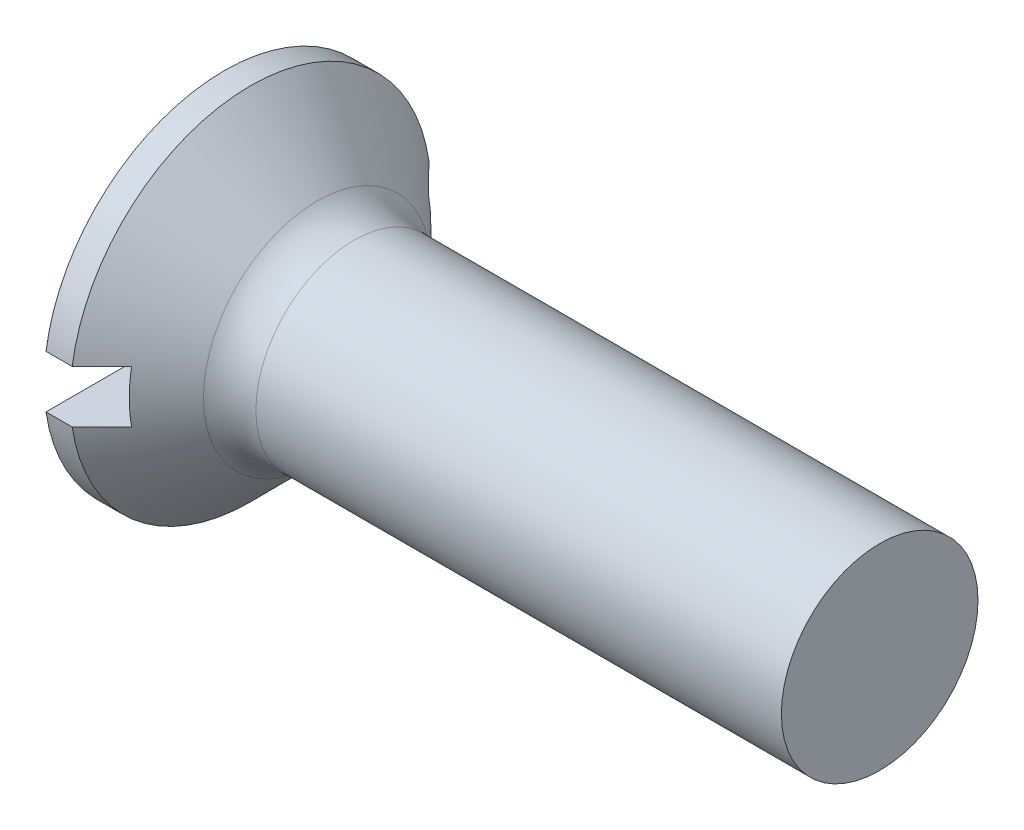
ISO-10303-21;
HEADER;
FILE_DESCRIPTION(('STEP AP214'),'2;1');
FILE_NAME('part.step','',(''),(''),'','','');
FILE_SCHEMA(('AUTOMOTIVE_DESIGN { 1 0 10303 214 1 1 1 1 }'));
ENDSEC;
DATA;
#1=APPLICATION_CONTEXT('core data for automotive mechanical design processes');
#2=APPLICATION_PROTOCOL_DEFINITION('international standard','automotive_design',2000,#1);
#3=PRODUCT_CONTEXT('',#1,'mechanical');
#4=PRODUCT('Part','Part','',(#3));
#5=PRODUCT_RELATED_PRODUCT_CATEGORY('part','',(#4));
#6=PRODUCT_DEFINITION_FORMATION('','',#4);
#7=PRODUCT_DEFINITION_CONTEXT('part definition',#1,'design');
#8=PRODUCT_DEFINITION('design','',#6,#7);
#9=PRODUCT_DEFINITION_SHAPE('','',#8);
#10=(LENGTH_UNIT() NAMED_UNIT(*) SI_UNIT(.MILLI.,.METRE.));
#11=(NAMED_UNIT(*) PLANE_ANGLE_UNIT() SI_UNIT($,.RADIAN.));
#12=(NAMED_UNIT(*) SI_UNIT($,.STERADIAN.) SOLID_ANGLE_UNIT());
#13=UNCERTAINTY_MEASURE_WITH_UNIT(LENGTH_MEASURE(1.E-05),#10,'distance_accuracy_value','');
#14=(GEOMETRIC_REPRESENTATION_CONTEXT(3) GLOBAL_UNCERTAINTY_ASSIGNED_CONTEXT((#13)) GLOBAL_UNIT_ASSIGNED_CONTEXT((#10,
#11,#12)) REPRESENTATION_CONTEXT('',''));
#15=CARTESIAN_POINT('',(0.,0.,0.));
#16=DIRECTION('',(0.,0.,1.));
#17=DIRECTION('',(1.,0.,0.));
#18=AXIS2_PLACEMENT_3D('',#15,#16,#17);
#19=CARTESIAN_POINT('',(-6.34999999999999,0.,0.));
#20=DIRECTION('',(-1.,0.,0.));
#21=DIRECTION('',(0.,0.,1.));
#22=AXIS2_PLACEMENT_3D('',#19,#20,#21);
#23=CYLINDRICAL_SURFACE('',#22,2.75);
#24=DIRECTION('',(-1.,0.,0.));
#25=VECTOR('',#24,1.);
#26=CARTESIAN_POINT('',(-6.34999999999999,0.4,-2.72075357208256));
#27=LINE('',#26,#25);
#28=CARTESIAN_POINT('',(0.,0.4,-2.72075357208256));
#29=VERTEX_POINT('',#28);
#30=CARTESIAN_POINT('',(0.400000000000005,0.4,-2.72075357208256));
#31=VERTEX_POINT('',#30);
#32=EDGE_CURVE('E55',#29,#31,#27,.F.);
#33=ORIENTED_EDGE('',*,*,#32,.F.);
#34=CARTESIAN_POINT('',(0.,0.,0.));
#35=DIRECTION('',(-1.,0.,0.));
#36=DIRECTION('',(0.,0.,1.));
#37=AXIS2_PLACEMENT_3D('',#34,#35,#36);
#38=CIRCLE('',#37,2.75);
#39=CARTESIAN_POINT('',(0.,0.4,2.72075357208256));
#40=VERTEX_POINT('',#39);
#41=EDGE_CURVE('E103',#40,#29,#38,.T.);
#42=ORIENTED_EDGE('',*,*,#41,.F.);
#43=DIRECTION('',(-1.,0.,0.));
#44=VECTOR('',#43,1.);
#45=CARTESIAN_POINT('',(-6.34999999999999,0.4,2.72075357208256));
#46=LINE('',#45,#44);
#47=CARTESIAN_POINT('',(0.400000000000005,0.4,2.72075357208256));
#48=VERTEX_POINT('',#47);
#49=EDGE_CURVE('E160',#48,#40,#46,.T.);
#50=ORIENTED_EDGE('',*,*,#49,.F.);
#51=CARTESIAN_POINT('',(0.400000000000005,0.,0.));
#52=DIRECTION('',(-1.,0.,0.));
#53=DIRECTION('',(0.,0.,1.));
#54=AXIS2_PLACEMENT_3D('',#51,#52,#53);
#55=CIRCLE('',#54,2.75);
#56=EDGE_CURVE('E112',#48,#31,#55,.T.);
#57=ORIENTED_EDGE('',*,*,#56,.T.);
#58=EDGE_LOOP('',(#33,#42,#50,#57));
#59=FACE_BOUND('',#58,.T.);
#60=ADVANCED_FACE('F32',(#59),#23,.T.);
#61=CARTESIAN_POINT('',(0.,0.,0.));
#62=DIRECTION('',(-1.,0.,0.));
#63=DIRECTION('',(0.,0.,1.));
#64=AXIS2_PLACEMENT_3D('',#61,#62,#63);
#65=PLANE('',#64);
#66=DIRECTION('',(0.,0.,-1.));
#67=VECTOR('',#66,1.);
#68=CARTESIAN_POINT('',(0.,0.4,0.));
#69=LINE('',#68,#67);
#70=EDGE_CURVE('E90',#40,#29,#69,.T.);
#71=ORIENTED_EDGE('',*,*,#70,.F.);
#72=ORIENTED_EDGE('',*,*,#41,.T.);
#73=EDGE_LOOP('',(#71,#72));
#74=FACE_BOUND('',#73,.T.);
#75=ADVANCED_FACE('F166',(#74),#65,.T.);
#76=CARTESIAN_POINT('',(10.,1.5,0.));
#77=DIRECTION('',(1.,0.,0.));
#78=DIRECTION('',(0.,0.,-1.));
#79=AXIS2_PLACEMENT_3D('',#76,#77,#78);
#80=PLANE('',#79);
#81=CARTESIAN_POINT('',(10.,0.,0.));
#82=DIRECTION('',(-1.,0.,0.));
#83=DIRECTION('',(0.,0.,1.));
#84=AXIS2_PLACEMENT_3D('',#81,#82,#83);
#85=CIRCLE('',#84,1.5);
#86=CARTESIAN_POINT('',(10.,0.,1.5));
#87=VERTEX_POINT('',#86);
#88=EDGE_CURVE('E113',#87,#87,#85,.T.);
#89=ORIENTED_EDGE('',*,*,#88,.F.);
#90=EDGE_LOOP('',(#89));
#91=FACE_BOUND('',#90,.T.);
#92=ADVANCED_FACE('F168',(#91),#80,.T.);
#93=CARTESIAN_POINT('',(-6.34999999999999,0.,0.));
#94=DIRECTION('',(-1.,0.,0.));
#95=DIRECTION('',(0.,0.,1.));
#96=AXIS2_PLACEMENT_3D('',#93,#94,#95);
#97=CYLINDRICAL_SURFACE('',#96,1.5);
#98=CARTESIAN_POINT('',(1.98137084989848,0.,0.));
#99=DIRECTION('',(-1.,0.,0.));
#100=DIRECTION('',(0.,0.,1.));
#101=AXIS2_PLACEMENT_3D('',#98,#99,#100);
#102=CIRCLE('',#101,1.5);
#103=CARTESIAN_POINT('',(1.98137084989848,0.,1.5));
#104=VERTEX_POINT('',#103);
#105=EDGE_CURVE('E91',#104,#104,#102,.F.);
#106=ORIENTED_EDGE('',*,*,#105,.T.);
#107=EDGE_LOOP('',(#106));
#108=FACE_BOUND('',#107,.T.);
#109=ORIENTED_EDGE('',*,*,#88,.T.);
#110=EDGE_LOOP('',(#109));
#111=FACE_BOUND('',#110,.T.);
#112=ADVANCED_FACE('F173',(#108,#111),#97,.T.);
#113=CARTESIAN_POINT('',(0.400000000000005,0.,0.));
#114=DIRECTION('',(-1.,0.,0.));
#115=DIRECTION('',(0.,0.,1.));
#116=AXIS2_PLACEMENT_3D('',#113,#114,#115);
#117=CONICAL_SURFACE('',#116,2.75,0.78539816339745);
#118=CARTESIAN_POINT('',(-2.91122703099808,0.399999999999999,-6.04801398157296));
#119=CARTESIAN_POINT('',(-2.70333669995712,0.399999999999999,-5.83966573752139));
#120=CARTESIAN_POINT('',(-2.49546630031166,0.399999999999999,-5.63129758737052));
#121=CARTESIAN_POINT('',(-2.07978706521848,0.399999999999999,-5.2144912620075));
#122=CARTESIAN_POINT('',(-1.87197823113852,0.399999999999999,-5.00605308543134));
#123=CARTESIAN_POINT('',(-1.45635477241037,0.399999999999999,-4.58898711382912));
#124=CARTESIAN_POINT('',(-1.2485401909839,0.399999999999999,-4.38035927572767));
#125=CARTESIAN_POINT('',(-0.833054486611349,0.399999999999999,-3.96296915720086));
#126=CARTESIAN_POINT('',(-0.625383360847279,0.399999999999999,-3.75420687958157));
#127=CARTESIAN_POINT('',(-0.208177797150706,0.399999999999999,-3.33435396336398));
#128=CARTESIAN_POINT('',(0.00135434759481753,0.4,-3.12326104596609));
#129=CARTESIAN_POINT('',(0.420030451513073,0.4,-2.70066518043499));
#130=CARTESIAN_POINT('',(0.629174386878202,0.4,-2.48916220868138));
#131=CARTESIAN_POINT('',(0.942224156138593,0.4,-2.1713129981671));
#132=CARTESIAN_POINT('',(1.04644766129475,0.4,-2.06527989301767));
#133=CARTESIAN_POINT('',(1.25455725538018,0.4,-1.85287805131423));
#134=CARTESIAN_POINT('',(1.35844333617521,0.4,-1.7465093067891));
#135=CARTESIAN_POINT('',(1.56564763937195,0.4,-1.53324094855307));
#136=CARTESIAN_POINT('',(1.66896592306241,0.4,-1.42634139460757));
#137=CARTESIAN_POINT('',(1.82313895681254,0.4,-1.26522565766366));
#138=CARTESIAN_POINT('',(1.87439491657569,0.4,-1.21139372905201));
#139=CARTESIAN_POINT('',(1.9765104755376,0.4,-1.10335558747567));
#140=CARTESIAN_POINT('',(2.02737008031461,0.4,-1.04914937979886));
#141=CARTESIAN_POINT('',(2.10536761914265,0.4,-0.965078768929768));
#142=CARTESIAN_POINT('',(2.13272119248435,0.4,-0.935414601324456));
#143=CARTESIAN_POINT('',(2.18719151166742,0.4,-0.875868286782248));
#144=CARTESIAN_POINT('',(2.21430825226833,0.4,-0.845986135048678));
#145=CARTESIAN_POINT('',(2.26822565449431,0.4,-0.785940027475329));
#146=CARTESIAN_POINT('',(2.29502633530682,0.4,-0.755776088943663));
#147=CARTESIAN_POINT('',(2.34818681038839,0.4,-0.695065970456104));
#148=CARTESIAN_POINT('',(2.37454662451584,0.4,-0.664519807826037));
#149=CARTESIAN_POINT('',(2.43976155242959,0.4,-0.587422608894616));
#150=CARTESIAN_POINT('',(2.4782379170761,0.4,-0.540543920717876));
#151=CARTESIAN_POINT('',(2.53401321051795,0.4,-0.468681597610833));
#152=CARTESIAN_POINT('',(2.55228877360357,0.4,-0.444459986191995));
#153=CARTESIAN_POINT('',(2.5878711479654,0.4,-0.39531915610884));
#154=CARTESIAN_POINT('',(2.60517823468484,0.4,-0.370400138848683));
#155=CARTESIAN_POINT('',(2.64157672655789,0.4,-0.314684261327312));
#156=CARTESIAN_POINT('',(2.66036306205222,0.4,-0.28368484243835));
#157=CARTESIAN_POINT('',(2.69440764635418,0.4,-0.219761693796643));
#158=CARTESIAN_POINT('',(2.70967206186428,0.4,-0.186841455937733));
#159=CARTESIAN_POINT('',(2.73016014153724,0.4,-0.129375221596078));
#160=CARTESIAN_POINT('',(2.73703138273339,0.4,-0.105439966049049));
#161=CARTESIAN_POINT('',(2.74668434716516,0.4,-0.0567945818244743));
#162=CARTESIAN_POINT('',(2.74948035548682,0.4,-0.0320874714607019));
#163=CARTESIAN_POINT('',(2.75038742305556,0.4,0.0175418217821301));
#164=CARTESIAN_POINT('',(2.74847509810649,0.4,0.0424644630823507));
#165=CARTESIAN_POINT('',(2.7403655224137,0.4,0.0916234589116821));
#166=CARTESIAN_POINT('',(2.73415677384007,0.4,0.115857789823385));
#167=CARTESIAN_POINT('',(2.71827371927204,0.4,0.164097461973524));
#168=CARTESIAN_POINT('',(2.70848082711735,0.4,0.188061916430982));
#169=CARTESIAN_POINT('',(2.68657810309996,0.4,0.234925488056131));
#170=CARTESIAN_POINT('',(2.67446406551726,0.4,0.257822576152259));
#171=CARTESIAN_POINT('',(2.64859519565537,0.4,0.302903050832693));
#172=CARTESIAN_POINT('',(2.63482775852877,0.4,0.325079071971884));
#173=CARTESIAN_POINT('',(2.60624001527761,0.4,0.368705812927868));
#174=CARTESIAN_POINT('',(2.59142061970022,0.4,0.390157136844758));
#175=CARTESIAN_POINT('',(2.54324495089253,0.4,0.457380684412003));
#176=CARTESIAN_POINT('',(2.5085311578627,0.4,0.502172551984684));
#177=CARTESIAN_POINT('',(2.4373574689067,0.4,0.590355519981424));
#178=CARTESIAN_POINT('',(2.40089644203552,0.4,0.633745681848963));
#179=CARTESIAN_POINT('',(2.32688330317303,0.4,0.719722652435567));
#180=CARTESIAN_POINT('',(2.28932931399318,0.4,0.762307843089061));
#181=CARTESIAN_POINT('',(2.21358878416378,0.4,0.846885546517387));
#182=CARTESIAN_POINT('',(2.17540243181154,0.4,0.888878229061745));
#183=CARTESIAN_POINT('',(2.06044068334854,0.4,1.01402227230979));
#184=CARTESIAN_POINT('',(1.98303698108055,0.4,1.09659540299884));
#185=CARTESIAN_POINT('',(1.82747335677727,0.4,1.26085212091516));
#186=CARTESIAN_POINT('',(1.74931433456999,0.4,1.34253656700302));
#187=CARTESIAN_POINT('',(1.59286602877705,0.4,1.50504082503211));
#188=CARTESIAN_POINT('',(1.51457909296922,0.4,1.58586289734369));
#189=CARTESIAN_POINT('',(1.35769196697884,0.4,1.74720261153539));
#190=CARTESIAN_POINT('',(1.27909177531288,0.4,1.82772025197037));
#191=CARTESIAN_POINT('',(1.04297819662847,0.4,2.06897290850551));
#192=CARTESIAN_POINT('',(0.885154889242076,0.4,2.22940447684664));
#193=CARTESIAN_POINT('',(0.569022750342737,0.4,2.54992542692343));
#194=CARTESIAN_POINT('',(0.410713737476895,0.4,2.71001462943086));
#195=CARTESIAN_POINT('',(0.093846751706257,0.4,3.02994348223417));
#196=CARTESIAN_POINT('',(-0.0647112188507847,0.4,3.18978313485537));
#197=CARTESIAN_POINT('',(-0.540591127347246,0.4,3.66904928426922));
#198=CARTESIAN_POINT('',(-0.858143098403681,0.400000000000001,3.98824727310349));
#199=CARTESIAN_POINT('',(-1.49349686932324,0.400000000000001,4.62632608508985));
#200=CARTESIAN_POINT('',(-1.81129863870678,0.400000000000001,4.94520693861199));
#201=CARTESIAN_POINT('',(-2.25950055023475,0.400000000000001,5.39470040618395));
#202=CARTESIAN_POINT('',(-2.38983276816512,0.400000000000001,5.5253807505132));
#203=CARTESIAN_POINT('',(-2.65051602794782,0.400000000000001,5.78671502436768));
#204=CARTESIAN_POINT('',(-2.78086706913672,0.400000000000001,5.91736895455466));
#205=CARTESIAN_POINT('',(-2.91122703099808,0.400000000000001,6.04801398157296));
#206=B_SPLINE_CURVE_WITH_KNOTS('',3,(#118,#119,#120,#121,#122,#123,#124,#125,#126,#127,#128,
#129,#130,#131,#132,#133,#134,#135,#136,#137,#138,#139,#140,#141,#142,#143,#144,#145,#146,#147,
#148,#149,#150,#151,#152,#153,#154,#155,#156,#157,#158,#159,#160,#161,#162,#163,#164,#165,#166,
#167,#168,#169,#170,#171,#172,#173,#174,#175,#176,#177,#178,#179,#180,#181,#182,#183,#184,#185,
#186,#187,#188,#189,#190,#191,#192,#193,#194,#195,#196,#197,#198,#199,#200,#201,#202,#203,#204,
#205),.UNSPECIFIED.,.F.,.F.,(4,2,2,2,2,2,2,2,2,2,2,2,2,2,2,2,2,2,2,2,2,2,2,2,2,2,2,2,2,2,2,2,2,
2,2,2,2,2,2,2,2,2,2,4),(0.,0.882975910860478,1.76597015363403,2.64937958225391,3.53277113384024,
4.42505762724969,5.31739714423807,5.76343472500757,6.20948297970986,6.65548210253547,
6.87847301535126,7.10146078413753,7.22251193727136,7.34356576218222,7.46461219989591,
7.58565317043343,7.7675312303056,7.85854400270903,7.94953075732351,8.05816632031485,
8.16661019949531,8.24105170239749,8.31523162951187,8.38978071779309,8.46453008531399,
8.54201686233401,8.61964538973785,8.69790858090398,8.77610483669631,8.94600506687254,
9.11601679556836,9.28634010861835,9.45661358569747,9.79613758747497,10.1352975424543,
10.4728599134667,10.8104238848897,11.4855651220709,12.1610000728679,12.8364286918874,
14.1871833908349,15.5377930820782,16.0914848296691,16.6451603543132),.UNSPECIFIED.);
#207=CARTESIAN_POINT('',(0.85,0.4,-2.26495033058123));
#208=VERTEX_POINT('',#207);
#209=EDGE_CURVE('E104',#31,#208,#206,.T.);
#210=ORIENTED_EDGE('',*,*,#209,.F.);
#211=ORIENTED_EDGE('',*,*,#56,.F.);
#212=CARTESIAN_POINT('',(0.85,0.4,2.26495033058123));
#213=VERTEX_POINT('',#212);
#214=EDGE_CURVE('E108',#213,#48,#206,.T.);
#215=ORIENTED_EDGE('',*,*,#214,.F.);
#216=CARTESIAN_POINT('',(0.85,0.,0.));
#217=DIRECTION('',(-1.,0.,0.));
#218=DIRECTION('',(0.,0.,1.));
#219=AXIS2_PLACEMENT_3D('',#216,#217,#218);
#220=CIRCLE('',#219,2.3);
#221=CARTESIAN_POINT('',(0.85,-0.400000000000001,2.26495033058123));
#222=VERTEX_POINT('',#221);
#223=EDGE_CURVE('E36',#213,#222,#220,.F.);
#224=ORIENTED_EDGE('',*,*,#223,.T.);
#225=CARTESIAN_POINT('',(-2.91122703099808,-0.400000000000001,6.04801398157296));
#226=CARTESIAN_POINT('',(-2.70333669995712,-0.400000000000001,5.83966573752139));
#227=CARTESIAN_POINT('',(-2.49546630031166,-0.400000000000001,5.63129758737052));
#228=CARTESIAN_POINT('',(-2.07978706521847,-0.400000000000001,5.2144912620075));
#229=CARTESIAN_POINT('',(-1.87197823113852,-0.400000000000001,5.00605308543134));
#230=CARTESIAN_POINT('',(-1.45635477241037,-0.400000000000001,4.58898711382912));
#231=CARTESIAN_POINT('',(-1.2485401909839,-0.400000000000001,4.38035927572767));
#232=CARTESIAN_POINT('',(-0.833054486611349,-0.400000000000001,3.96296915720086));
#233=CARTESIAN_POINT('',(-0.625383360847279,-0.400000000000001,3.75420687958157));
#234=CARTESIAN_POINT('',(-0.208177797150705,-0.400000000000001,3.33435396336398));
#235=CARTESIAN_POINT('',(0.00135434759481899,-0.400000000000001,3.12326104596609));
#236=CARTESIAN_POINT('',(0.420030451513074,-0.400000000000001,2.70066518043499));
#237=CARTESIAN_POINT('',(0.629174386878203,-0.400000000000001,2.48916220868137));
#238=CARTESIAN_POINT('',(0.942224156138594,-0.400000000000001,2.1713129981671));
#239=CARTESIAN_POINT('',(1.04644766129475,-0.400000000000001,2.06527989301766));
#240=CARTESIAN_POINT('',(1.25455725538018,-0.400000000000001,1.85287805131423));
#241=CARTESIAN_POINT('',(1.35844333617521,-0.400000000000001,1.7465093067891));
#242=CARTESIAN_POINT('',(1.56564763937195,-0.400000000000001,1.53324094855307));
#243=CARTESIAN_POINT('',(1.66896592306241,-0.400000000000001,1.42634139460756));
#244=CARTESIAN_POINT('',(1.82313895681255,-0.400000000000001,1.26522565766366));
#245=CARTESIAN_POINT('',(1.87439491657569,-0.400000000000001,1.211393729052));
#246=CARTESIAN_POINT('',(1.97651047553761,-0.400000000000001,1.10335558747567));
#247=CARTESIAN_POINT('',(2.02737008031461,-0.400000000000001,1.04914937979886));
#248=CARTESIAN_POINT('',(2.10536761914265,-0.400000000000001,0.965078768929766));
#249=CARTESIAN_POINT('',(2.13272119248435,-0.400000000000001,0.935414601324454));
#250=CARTESIAN_POINT('',(2.18719151166742,-0.400000000000001,0.875868286782245));
#251=CARTESIAN_POINT('',(2.21430825226833,-0.400000000000001,0.845986135048675));
#252=CARTESIAN_POINT('',(2.26822565449431,-0.400000000000001,0.785940027475326));
#253=CARTESIAN_POINT('',(2.29502633530682,-0.400000000000001,0.755776088943661));
#254=CARTESIAN_POINT('',(2.3481868103884,-0.400000000000001,0.695065970456102));
#255=CARTESIAN_POINT('',(2.37454662451584,-0.400000000000001,0.664519807826035));
#256=CARTESIAN_POINT('',(2.43976155242959,-0.400000000000001,0.587422608894614));
#257=CARTESIAN_POINT('',(2.4782379170761,-0.400000000000001,0.540543920717874));
#258=CARTESIAN_POINT('',(2.53401321051796,-0.400000000000001,0.468681597610831));
#259=CARTESIAN_POINT('',(2.55228877360357,-0.400000000000001,0.444459986191993));
#260=CARTESIAN_POINT('',(2.5878711479654,-0.400000000000001,0.395319156108837));
#261=CARTESIAN_POINT('',(2.60517823468485,-0.400000000000001,0.37040013884868));
#262=CARTESIAN_POINT('',(2.64157672655789,-0.400000000000001,0.314684261327309));
#263=CARTESIAN_POINT('',(2.66036306205222,-0.400000000000001,0.283684842438347));
#264=CARTESIAN_POINT('',(2.69440764635418,-0.400000000000001,0.219761693796641));
#265=CARTESIAN_POINT('',(2.70967206186428,-0.400000000000001,0.186841455937732));
#266=CARTESIAN_POINT('',(2.73016014153724,-0.400000000000001,0.129375221596077));
#267=CARTESIAN_POINT('',(2.73703138273339,-0.400000000000001,0.105439966049048));
#268=CARTESIAN_POINT('',(2.74668434716516,-0.400000000000001,0.056794581824473));
#269=CARTESIAN_POINT('',(2.74948035548682,-0.400000000000001,0.0320874714607006));
#270=CARTESIAN_POINT('',(2.75038742305555,-0.400000000000001,-0.0175418217821318));
#271=CARTESIAN_POINT('',(2.74847509810649,-0.400000000000001,-0.0424644630823528));
#272=CARTESIAN_POINT('',(2.7403655224137,-0.400000000000001,-0.0916234589116841));
#273=CARTESIAN_POINT('',(2.73415677384007,-0.400000000000001,-0.115857789823386));
#274=CARTESIAN_POINT('',(2.71827371927204,-0.400000000000001,-0.164097461973525));
#275=CARTESIAN_POINT('',(2.70848082711735,-0.400000000000001,-0.188061916430984));
#276=CARTESIAN_POINT('',(2.68657810309996,-0.400000000000001,-0.234925488056133));
#277=CARTESIAN_POINT('',(2.67446406551725,-0.400000000000001,-0.257822576152262));
#278=CARTESIAN_POINT('',(2.64859519565537,-0.400000000000001,-0.302903050832697));
#279=CARTESIAN_POINT('',(2.63482775852876,-0.400000000000001,-0.325079071971888));
#280=CARTESIAN_POINT('',(2.60624001527761,-0.400000000000001,-0.368705812927873));
#281=CARTESIAN_POINT('',(2.59142061970022,-0.400000000000001,-0.390157136844761));
#282=CARTESIAN_POINT('',(2.54324495089253,-0.400000000000001,-0.457380684412007));
#283=CARTESIAN_POINT('',(2.5085311578627,-0.400000000000001,-0.502172551984688));
#284=CARTESIAN_POINT('',(2.43735746890669,-0.400000000000001,-0.590355519981429));
#285=CARTESIAN_POINT('',(2.40089644203552,-0.400000000000001,-0.633745681848969));
#286=CARTESIAN_POINT('',(2.32688330317302,-0.400000000000001,-0.719722652435574));
#287=CARTESIAN_POINT('',(2.28932931399317,-0.400000000000001,-0.762307843089068));
#288=CARTESIAN_POINT('',(2.21358878416377,-0.400000000000001,-0.846885546517395));
#289=CARTESIAN_POINT('',(2.17540243181154,-0.400000000000001,-0.888878229061753));
#290=CARTESIAN_POINT('',(2.06044068334853,-0.400000000000001,-1.01402227230979));
#291=CARTESIAN_POINT('',(1.98303698108054,-0.400000000000001,-1.09659540299885));
#292=CARTESIAN_POINT('',(1.82747335677725,-0.400000000000001,-1.26085212091518));
#293=CARTESIAN_POINT('',(1.74931433456998,-0.400000000000001,-1.34253656700303));
#294=CARTESIAN_POINT('',(1.59286602877704,-0.400000000000001,-1.50504082503213));
#295=CARTESIAN_POINT('',(1.51457909296921,-0.400000000000001,-1.5858628973437));
#296=CARTESIAN_POINT('',(1.35769196697882,-0.400000000000001,-1.74720261153541));
#297=CARTESIAN_POINT('',(1.27909177531287,-0.400000000000001,-1.82772025197039));
#298=CARTESIAN_POINT('',(1.04297819662845,-0.400000000000001,-2.06897290850553));
#299=CARTESIAN_POINT('',(0.885154889242053,-0.400000000000001,-2.22940447684666));
#300=CARTESIAN_POINT('',(0.56902275034271,-0.400000000000001,-2.54992542692346));
#301=CARTESIAN_POINT('',(0.410713737476867,-0.400000000000001,-2.71001462943089));
#302=CARTESIAN_POINT('',(0.0938467517062253,-0.400000000000001,-3.0299434822342));
#303=CARTESIAN_POINT('',(-0.0647112188508182,-0.400000000000001,-3.1897831348554));
#304=CARTESIAN_POINT('',(-0.540591127347285,-0.400000000000001,-3.66904928426926));
#305=CARTESIAN_POINT('',(-0.858143098403724,-0.400000000000001,-3.98824727310353));
#306=CARTESIAN_POINT('',(-1.49349686932329,-0.400000000000001,-4.62632608508989));
#307=CARTESIAN_POINT('',(-1.81129863870683,-0.400000000000001,-4.94520693861204));
#308=CARTESIAN_POINT('',(-2.25950055023479,-0.400000000000001,-5.394700406184));
#309=CARTESIAN_POINT('',(-2.38983276816516,-0.400000000000001,-5.52538075051324));
#310=CARTESIAN_POINT('',(-2.65051602794784,-0.400000000000001,-5.7867150243677));
#311=CARTESIAN_POINT('',(-2.78086706913673,-0.400000000000001,-5.91736895455467));
#312=CARTESIAN_POINT('',(-2.91122703099808,-0.400000000000001,-6.04801398157296));
#313=B_SPLINE_CURVE_WITH_KNOTS('',3,(#225,#226,#227,#228,#229,#230,#231,#232,#233,#234,#235,
#236,#237,#238,#239,#240,#241,#242,#243,#244,#245,#246,#247,#248,#249,#250,#251,#252,#253,#254,
#255,#256,#257,#258,#259,#260,#261,#262,#263,#264,#265,#266,#267,#268,#269,#270,#271,#272,#273,
#274,#275,#276,#277,#278,#279,#280,#281,#282,#283,#284,#285,#286,#287,#288,#289,#290,#291,#292,
#293,#294,#295,#296,#297,#298,#299,#300,#301,#302,#303,#304,#305,#306,#307,#308,#309,#310,#311,
#312),.UNSPECIFIED.,.F.,.F.,(4,2,2,2,2,2,2,2,2,2,2,2,2,2,2,2,2,2,2,2,2,2,2,2,2,2,2,2,2,2,2,2,2,
2,2,2,2,2,2,2,2,2,2,4),(0.,0.882975910860477,1.76597015363403,2.6493795822539,3.53277113384024,
4.42505762724969,5.31739714423807,5.76343472500757,6.20948297970986,6.65548210253547,
6.87847301535126,7.10146078413754,7.22251193727136,7.34356576218222,7.46461219989591,
7.58565317043343,7.7675312303056,7.85854400270903,7.94953075732351,8.05816632031486,
8.16661019949531,8.24105170239749,8.31523162951187,8.38978071779309,8.46453008531399,
8.542016862334,8.61964538973785,8.69790858090398,8.77610483669631,8.94600506687254,
9.11601679556837,9.28634010861835,9.45661358569748,9.79613758747498,10.1352975424543,
10.4728599134667,10.8104238848897,11.4855651220709,12.1610000728679,12.8364286918874,
14.1871833908349,15.5377930820783,16.0914848296691,16.6451603543132),.UNSPECIFIED.);
#314=CARTESIAN_POINT('',(0.400000000000005,-0.400000000000001,2.72075357208256));
#315=VERTEX_POINT('',#314);
#316=EDGE_CURVE('E99',#315,#222,#313,.T.);
#317=ORIENTED_EDGE('',*,*,#316,.F.);
#318=CARTESIAN_POINT('',(0.400000000000005,-0.400000000000001,-2.72075357208256));
#319=VERTEX_POINT('',#318);
#320=EDGE_CURVE('E98',#319,#315,#55,.T.);
#321=ORIENTED_EDGE('',*,*,#320,.F.);
#322=CARTESIAN_POINT('',(0.85,-0.400000000000001,-2.26495033058123));
#323=VERTEX_POINT('',#322);
#324=EDGE_CURVE('E100',#323,#319,#313,.T.);
#325=ORIENTED_EDGE('',*,*,#324,.F.);
#326=EDGE_CURVE('E11',#323,#208,#220,.F.);
#327=ORIENTED_EDGE('',*,*,#326,.T.);
#328=EDGE_LOOP('',(#210,#211,#215,#224,#317,#321,#325,#327));
#329=FACE_BOUND('',#328,.T.);
#330=CARTESIAN_POINT('',(1.41568542494924,0.,0.));
#331=DIRECTION('',(-1.,0.,0.));
#332=DIRECTION('',(0.,0.,1.));
#333=AXIS2_PLACEMENT_3D('',#330,#331,#332);
#334=CIRCLE('',#333,1.73431457505076);
#335=CARTESIAN_POINT('',(1.41568542494924,0.,1.73431457505076));
#336=VERTEX_POINT('',#335);
#337=EDGE_CURVE('E116',#336,#336,#334,.T.);
#338=ORIENTED_EDGE('',*,*,#337,.T.);
#339=EDGE_LOOP('',(#338));
#340=FACE_BOUND('',#339,.T.);
#341=ADVANCED_FACE('F124',(#329,#340),#117,.T.);
#342=DIRECTION('',(-1.,0.,0.));
#343=VECTOR('',#342,1.);
#344=CARTESIAN_POINT('',(-6.34999999999999,-0.400000000000001,2.72075357208256));
#345=LINE('',#344,#343);
#346=CARTESIAN_POINT('',(0.,-0.400000000000001,2.72075357208256));
#347=VERTEX_POINT('',#346);
#348=EDGE_CURVE('E85',#347,#315,#345,.F.);
#349=ORIENTED_EDGE('',*,*,#348,.F.);
#350=CARTESIAN_POINT('',(0.,-0.400000000000001,-2.72075357208256));
#351=VERTEX_POINT('',#350);
#352=EDGE_CURVE('E96',#351,#347,#38,.T.);
#353=ORIENTED_EDGE('',*,*,#352,.F.);
#354=DIRECTION('',(-1.,0.,0.));
#355=VECTOR('',#354,1.);
#356=CARTESIAN_POINT('',(-6.34999999999999,-0.400000000000001,-2.72075357208256));
#357=LINE('',#356,#355);
#358=EDGE_CURVE('E47',#319,#351,#357,.T.);
#359=ORIENTED_EDGE('',*,*,#358,.F.);
#360=ORIENTED_EDGE('',*,*,#320,.T.);
#361=EDGE_LOOP('',(#349,#353,#359,#360));
#362=FACE_BOUND('',#361,.T.);
#363=ADVANCED_FACE('F95',(#362),#23,.T.);
#364=DIRECTION('',(0.,0.,1.));
#365=VECTOR('',#364,1.);
#366=CARTESIAN_POINT('',(0.,-0.400000000000001,0.));
#367=LINE('',#366,#365);
#368=EDGE_CURVE('E82',#351,#347,#367,.T.);
#369=ORIENTED_EDGE('',*,*,#368,.F.);
#370=ORIENTED_EDGE('',*,*,#352,.T.);
#371=EDGE_LOOP('',(#369,#370));
#372=FACE_BOUND('',#371,.T.);
#373=ADVANCED_FACE('F102',(#372),#65,.T.);
#374=CARTESIAN_POINT('',(1.98137084989848,0.,0.));
#375=DIRECTION('',(-1.,0.,0.));
#376=DIRECTION('',(0.,0.,1.));
#377=AXIS2_PLACEMENT_3D('',#374,#375,#376);
#378=TOROIDAL_SURFACE('',#377,2.3,0.8);
#379=ORIENTED_EDGE('',*,*,#105,.F.);
#380=EDGE_LOOP('',(#379));
#381=FACE_BOUND('',#380,.T.);
#382=ORIENTED_EDGE('',*,*,#337,.F.);
#383=EDGE_LOOP('',(#382));
#384=FACE_BOUND('',#383,.T.);
#385=ADVANCED_FACE('F34',(#381,#384),#378,.F.);
#386=CARTESIAN_POINT('',(0.85,0.4,2.75));
#387=DIRECTION('',(0.,1.,0.));
#388=DIRECTION('',(0.,0.,1.));
#389=AXIS2_PLACEMENT_3D('',#386,#387,#388);
#390=PLANE('',#389);
#391=ORIENTED_EDGE('',*,*,#209,.T.);
#392=DIRECTION('',(0.,0.,-1.));
#393=VECTOR('',#392,1.);
#394=CARTESIAN_POINT('',(0.85,0.4,2.75));
#395=LINE('',#394,#393);
#396=EDGE_CURVE('E132',#213,#208,#395,.T.);
#397=ORIENTED_EDGE('',*,*,#396,.F.);
#398=ORIENTED_EDGE('',*,*,#214,.T.);
#399=ORIENTED_EDGE('',*,*,#49,.T.);
#400=ORIENTED_EDGE('',*,*,#70,.T.);
#401=ORIENTED_EDGE('',*,*,#32,.T.);
#402=EDGE_LOOP('',(#391,#397,#398,#399,#400,#401));
#403=FACE_BOUND('',#402,.T.);
#404=ADVANCED_FACE('F135',(#403),#390,.F.);
#405=CARTESIAN_POINT('',(0.85,-0.400000000000001,-2.75));
#406=DIRECTION('',(0.,-1.,0.));
#407=DIRECTION('',(0.,0.,-1.));
#408=AXIS2_PLACEMENT_3D('',#405,#406,#407);
#409=PLANE('',#408);
#410=ORIENTED_EDGE('',*,*,#316,.T.);
#411=DIRECTION('',(0.,0.,1.));
#412=VECTOR('',#411,1.);
#413=CARTESIAN_POINT('',(0.85,-0.400000000000001,-2.75));
#414=LINE('',#413,#412);
#415=EDGE_CURVE('E134',#323,#222,#414,.T.);
#416=ORIENTED_EDGE('',*,*,#415,.F.);
#417=ORIENTED_EDGE('',*,*,#324,.T.);
#418=ORIENTED_EDGE('',*,*,#358,.T.);
#419=ORIENTED_EDGE('',*,*,#368,.T.);
#420=ORIENTED_EDGE('',*,*,#348,.T.);
#421=EDGE_LOOP('',(#410,#416,#417,#418,#419,#420));
#422=FACE_BOUND('',#421,.T.);
#423=ADVANCED_FACE('F84',(#422),#409,.F.);
#424=CARTESIAN_POINT('',(0.85,0.4,-2.75));
#425=DIRECTION('',(-1.,0.,0.));
#426=DIRECTION('',(0.,0.,1.));
#427=AXIS2_PLACEMENT_3D('',#424,#425,#426);
#428=PLANE('',#427);
#429=ORIENTED_EDGE('',*,*,#415,.T.);
#430=ORIENTED_EDGE('',*,*,#223,.F.);
#431=ORIENTED_EDGE('',*,*,#396,.T.);
#432=ORIENTED_EDGE('',*,*,#326,.F.);
#433=EDGE_LOOP('',(#429,#430,#431,#432));
#434=FACE_BOUND('',#433,.T.);
#435=ADVANCED_FACE('F131',(#434),#428,.T.);
#436=CLOSED_SHELL('',(#60,#75,#92,#112,#341,#363,#373,#385,#404,#423,#435));
#437=MANIFOLD_SOLID_BREP('B2',#436);
#438=ADVANCED_BREP_SHAPE_REPRESENTATION('',(#18,#437),#14);
#439=SHAPE_DEFINITION_REPRESENTATION(#9,#438);
ENDSEC;
END-ISO-10303-21;
